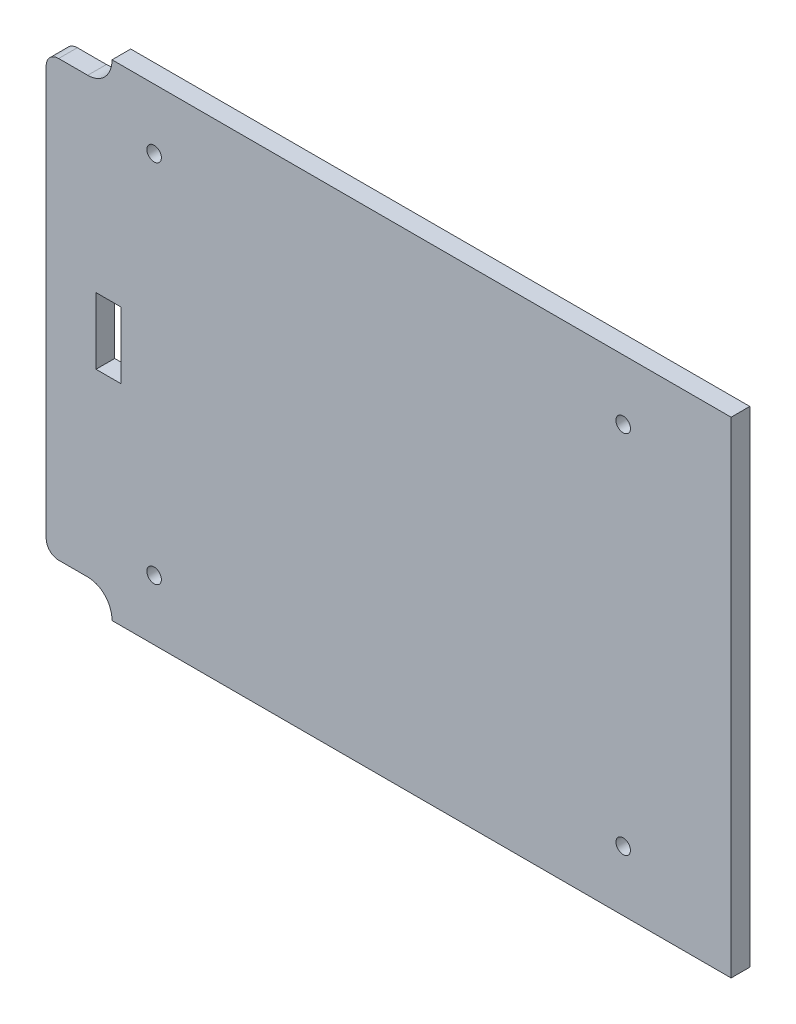
ISO-10303-21;
HEADER;
FILE_DESCRIPTION(('STEP AP214'),'2;1');
FILE_NAME('part.step','',(''),(''),'','','');
FILE_SCHEMA(('AUTOMOTIVE_DESIGN { 1 0 10303 214 1 1 1 1 }'));
ENDSEC;
DATA;
#1=APPLICATION_CONTEXT('core data for automotive mechanical design processes');
#2=APPLICATION_PROTOCOL_DEFINITION('international standard','automotive_design',2000,#1);
#3=PRODUCT_CONTEXT('',#1,'mechanical');
#4=PRODUCT('Part','Part','',(#3));
#5=PRODUCT_RELATED_PRODUCT_CATEGORY('part','',(#4));
#6=PRODUCT_DEFINITION_FORMATION('','',#4);
#7=PRODUCT_DEFINITION_CONTEXT('part definition',#1,'design');
#8=PRODUCT_DEFINITION('design','',#6,#7);
#9=PRODUCT_DEFINITION_SHAPE('','',#8);
#10=(LENGTH_UNIT() NAMED_UNIT(*) SI_UNIT(.MILLI.,.METRE.));
#11=(NAMED_UNIT(*) PLANE_ANGLE_UNIT() SI_UNIT($,.RADIAN.));
#12=(NAMED_UNIT(*) SI_UNIT($,.STERADIAN.) SOLID_ANGLE_UNIT());
#13=UNCERTAINTY_MEASURE_WITH_UNIT(LENGTH_MEASURE(1.E-05),#10,'distance_accuracy_value','');
#14=(GEOMETRIC_REPRESENTATION_CONTEXT(3) GLOBAL_UNCERTAINTY_ASSIGNED_CONTEXT((#13)) GLOBAL_UNIT_ASSIGNED_CONTEXT((#10,
#11,#12)) REPRESENTATION_CONTEXT('',''));
#15=CARTESIAN_POINT('',(0.,0.,0.));
#16=DIRECTION('',(0.,0.,1.));
#17=DIRECTION('',(1.,0.,0.));
#18=AXIS2_PLACEMENT_3D('',#15,#16,#17);
#19=CARTESIAN_POINT('',(82.5,-58.5,4.5));
#20=DIRECTION('',(0.,1.,0.));
#21=DIRECTION('',(-1.,0.,0.));
#22=AXIS2_PLACEMENT_3D('',#19,#20,#21);
#23=PLANE('',#22);
#24=DIRECTION('',(0.,0.,1.));
#25=VECTOR('',#24,1.);
#26=CARTESIAN_POINT('',(-66.6411254352264,-58.5,-0.00100000000000013));
#27=LINE('',#26,#25);
#28=CARTESIAN_POINT('',(-66.6411254352264,-58.5,0.));
#29=VERTEX_POINT('',#28);
#30=CARTESIAN_POINT('',(-66.6411254352264,-58.5,4.5));
#31=VERTEX_POINT('',#30);
#32=EDGE_CURVE('E159',#29,#31,#27,.T.);
#33=ORIENTED_EDGE('',*,*,#32,.F.);
#34=DIRECTION('',(1.,0.,0.));
#35=VECTOR('',#34,1.);
#36=CARTESIAN_POINT('',(82.5,-58.5,0.));
#37=LINE('',#36,#35);
#38=CARTESIAN_POINT('',(82.5,-58.5,0.));
#39=VERTEX_POINT('',#38);
#40=EDGE_CURVE('E172',#29,#39,#37,.T.);
#41=ORIENTED_EDGE('',*,*,#40,.T.);
#42=DIRECTION('',(0.,0.,-1.));
#43=VECTOR('',#42,1.);
#44=CARTESIAN_POINT('',(82.5,-58.5,4.5));
#45=LINE('',#44,#43);
#46=CARTESIAN_POINT('',(82.5,-58.5,4.5));
#47=VERTEX_POINT('',#46);
#48=EDGE_CURVE('E12',#47,#39,#45,.T.);
#49=ORIENTED_EDGE('',*,*,#48,.F.);
#50=DIRECTION('',(1.,0.,0.));
#51=VECTOR('',#50,1.);
#52=CARTESIAN_POINT('',(82.5,-58.5,4.5));
#53=LINE('',#52,#51);
#54=EDGE_CURVE('E173',#31,#47,#53,.T.);
#55=ORIENTED_EDGE('',*,*,#54,.F.);
#56=EDGE_LOOP('',(#33,#41,#49,#55));
#57=FACE_BOUND('',#56,.T.);
#58=ADVANCED_FACE('F40',(#57),#23,.F.);
#59=CARTESIAN_POINT('',(0.,0.,4.5));
#60=DIRECTION('',(0.,0.,1.));
#61=DIRECTION('',(1.,0.,0.));
#62=AXIS2_PLACEMENT_3D('',#59,#60,#61);
#63=PLANE('',#62);
#64=DIRECTION('',(0.,-1.,0.));
#65=VECTOR('',#64,1.);
#66=CARTESIAN_POINT('',(-70.5,-8.00000000000001,4.5));
#67=LINE('',#66,#65);
#68=CARTESIAN_POINT('',(-70.5,7.99999999999999,4.5));
#69=VERTEX_POINT('',#68);
#70=CARTESIAN_POINT('',(-70.5,-8.00000000000001,4.5));
#71=VERTEX_POINT('',#70);
#72=EDGE_CURVE('E275',#69,#71,#67,.T.);
#73=ORIENTED_EDGE('',*,*,#72,.F.);
#74=DIRECTION('',(-1.,0.,0.));
#75=VECTOR('',#74,1.);
#76=CARTESIAN_POINT('',(-64.5,7.99999999999999,4.5));
#77=LINE('',#76,#75);
#78=CARTESIAN_POINT('',(-64.5,7.99999999999999,4.5));
#79=VERTEX_POINT('',#78);
#80=EDGE_CURVE('E256',#79,#69,#77,.T.);
#81=ORIENTED_EDGE('',*,*,#80,.F.);
#82=DIRECTION('',(0.,1.,0.));
#83=VECTOR('',#82,1.);
#84=CARTESIAN_POINT('',(-64.5,-8.00000000000001,4.5));
#85=LINE('',#84,#83);
#86=CARTESIAN_POINT('',(-64.5,-8.00000000000001,4.5));
#87=VERTEX_POINT('',#86);
#88=EDGE_CURVE('E267',#87,#79,#85,.T.);
#89=ORIENTED_EDGE('',*,*,#88,.F.);
#90=DIRECTION('',(1.,0.,0.));
#91=VECTOR('',#90,1.);
#92=CARTESIAN_POINT('',(-64.5,-8.00000000000001,4.5));
#93=LINE('',#92,#91);
#94=EDGE_CURVE('E271',#71,#87,#93,.T.);
#95=ORIENTED_EDGE('',*,*,#94,.F.);
#96=EDGE_LOOP('',(#73,#81,#89,#95));
#97=FACE_BOUND('',#96,.T.);
#98=CARTESIAN_POINT('',(-56.5,-44.,4.5));
#99=DIRECTION('',(0.,0.,-1.));
#100=DIRECTION('',(1.,0.,0.));
#101=AXIS2_PLACEMENT_3D('',#98,#99,#100);
#102=CIRCLE('',#101,1.75);
#103=CARTESIAN_POINT('',(-54.75,-44.,4.5));
#104=VERTEX_POINT('',#103);
#105=EDGE_CURVE('E239',#104,#104,#102,.T.);
#106=ORIENTED_EDGE('',*,*,#105,.T.);
#107=EDGE_LOOP('',(#106));
#108=FACE_BOUND('',#107,.T.);
#109=CARTESIAN_POINT('',(56.5,-44.,4.5));
#110=DIRECTION('',(0.,0.,1.));
#111=DIRECTION('',(-1.,0.,0.));
#112=AXIS2_PLACEMENT_3D('',#109,#110,#111);
#113=CIRCLE('',#112,1.75);
#114=CARTESIAN_POINT('',(54.75,-44.,4.5));
#115=VERTEX_POINT('',#114);
#116=EDGE_CURVE('E231',#115,#115,#113,.T.);
#117=ORIENTED_EDGE('',*,*,#116,.F.);
#118=EDGE_LOOP('',(#117));
#119=FACE_BOUND('',#118,.T.);
#120=CARTESIAN_POINT('',(56.5,44.,4.5));
#121=DIRECTION('',(0.,0.,-1.));
#122=DIRECTION('',(-1.,0.,0.));
#123=AXIS2_PLACEMENT_3D('',#120,#121,#122);
#124=CIRCLE('',#123,1.75);
#125=CARTESIAN_POINT('',(54.75,44.,4.5));
#126=VERTEX_POINT('',#125);
#127=EDGE_CURVE('E223',#126,#126,#124,.T.);
#128=ORIENTED_EDGE('',*,*,#127,.T.);
#129=EDGE_LOOP('',(#128));
#130=FACE_BOUND('',#129,.T.);
#131=CARTESIAN_POINT('',(-56.5,44.,4.5));
#132=DIRECTION('',(0.,0.,1.));
#133=DIRECTION('',(1.,0.,0.));
#134=AXIS2_PLACEMENT_3D('',#131,#132,#133);
#135=CIRCLE('',#134,1.75);
#136=CARTESIAN_POINT('',(-54.75,44.,4.5));
#137=VERTEX_POINT('',#136);
#138=EDGE_CURVE('E215',#137,#137,#135,.T.);
#139=ORIENTED_EDGE('',*,*,#138,.F.);
#140=EDGE_LOOP('',(#139));
#141=FACE_BOUND('',#140,.T.);
#142=CARTESIAN_POINT('',(-72.4926257614116,-58.0906655237795,4.5));
#143=DIRECTION('',(0.,0.,-1.));
#144=DIRECTION('',(1.,0.,0.));
#145=AXIS2_PLACEMENT_3D('',#142,#143,#144);
#146=CIRCLE('',#145,5.752251219434);
#147=CARTESIAN_POINT('',(-72.4926257614116,-52.3384143043455,4.5));
#148=VERTEX_POINT('',#147);
#149=CARTESIAN_POINT('',(-67.3791599057483,-55.4561141322812,4.5));
#150=VERTEX_POINT('',#149);
#151=EDGE_CURVE('E166',#148,#150,#146,.T.);
#152=ORIENTED_EDGE('',*,*,#151,.T.);
#153=CARTESIAN_POINT('',(-73.2871131547698,-58.5,4.5));
#154=DIRECTION('',(0.,0.,-1.));
#155=DIRECTION('',(1.,0.,0.));
#156=AXIS2_PLACEMENT_3D('',#153,#154,#155);
#157=CIRCLE('',#156,6.64598771954342);
#158=EDGE_CURVE('E339',#150,#31,#157,.T.);
#159=ORIENTED_EDGE('',*,*,#158,.T.);
#160=ORIENTED_EDGE('',*,*,#54,.T.);
#161=DIRECTION('',(0.,1.,0.));
#162=VECTOR('',#161,1.);
#163=CARTESIAN_POINT('',(82.5,-58.5,4.5));
#164=LINE('',#163,#162);
#165=CARTESIAN_POINT('',(82.5,58.5,4.5));
#166=VERTEX_POINT('',#165);
#167=EDGE_CURVE('E204',#47,#166,#164,.T.);
#168=ORIENTED_EDGE('',*,*,#167,.T.);
#169=DIRECTION('',(-1.,0.,0.));
#170=VECTOR('',#169,1.);
#171=CARTESIAN_POINT('',(82.5,58.5,4.5));
#172=LINE('',#171,#170);
#173=CARTESIAN_POINT('',(-66.6411254352264,58.5,4.5));
#174=VERTEX_POINT('',#173);
#175=EDGE_CURVE('E198',#166,#174,#172,.T.);
#176=ORIENTED_EDGE('',*,*,#175,.T.);
#177=CARTESIAN_POINT('',(-73.2871131547698,58.5,4.5));
#178=DIRECTION('',(0.,0.,1.));
#179=DIRECTION('',(1.,0.,0.));
#180=AXIS2_PLACEMENT_3D('',#177,#178,#179);
#181=CIRCLE('',#180,6.64598771954342);
#182=CARTESIAN_POINT('',(-67.3791599057483,55.4561141322812,4.5));
#183=VERTEX_POINT('',#182);
#184=EDGE_CURVE('E314',#183,#174,#181,.T.);
#185=ORIENTED_EDGE('',*,*,#184,.F.);
#186=CARTESIAN_POINT('',(-72.4926257614116,58.0906655237795,4.5));
#187=DIRECTION('',(0.,0.,1.));
#188=DIRECTION('',(1.,0.,0.));
#189=AXIS2_PLACEMENT_3D('',#186,#187,#188);
#190=CIRCLE('',#189,5.752251219434);
#191=CARTESIAN_POINT('',(-72.4926257614116,52.3384143043455,4.5));
#192=VERTEX_POINT('',#191);
#193=EDGE_CURVE('E317',#192,#183,#190,.T.);
#194=ORIENTED_EDGE('',*,*,#193,.F.);
#195=DIRECTION('',(1.,0.,0.));
#196=VECTOR('',#195,1.);
#197=CARTESIAN_POINT('',(0.,52.3384143043455,4.5));
#198=LINE('',#197,#196);
#199=CARTESIAN_POINT('',(-79.5015936084169,52.3384143043455,4.5));
#200=VERTEX_POINT('',#199);
#201=EDGE_CURVE('E296',#200,#192,#198,.T.);
#202=ORIENTED_EDGE('',*,*,#201,.F.);
#203=CARTESIAN_POINT('',(-79.5015936084169,49.3400079127624,4.5));
#204=DIRECTION('',(0.,0.,1.));
#205=DIRECTION('',(1.,0.,0.));
#206=AXIS2_PLACEMENT_3D('',#203,#204,#205);
#207=CIRCLE('',#206,2.99840639158309);
#208=CARTESIAN_POINT('',(-82.5,49.3400079127624,4.5));
#209=VERTEX_POINT('',#208);
#210=EDGE_CURVE('E310',#209,#200,#207,.F.);
#211=ORIENTED_EDGE('',*,*,#210,.F.);
#212=DIRECTION('',(0.,-1.,0.));
#213=VECTOR('',#212,1.);
#214=CARTESIAN_POINT('',(-82.5,-58.5,4.5));
#215=LINE('',#214,#213);
#216=CARTESIAN_POINT('',(-82.5,-49.3400079127624,4.5));
#217=VERTEX_POINT('',#216);
#218=EDGE_CURVE('E195',#209,#217,#215,.T.);
#219=ORIENTED_EDGE('',*,*,#218,.T.);
#220=CARTESIAN_POINT('',(-79.5015936084169,-49.3400079127624,4.5));
#221=DIRECTION('',(0.,0.,-1.));
#222=DIRECTION('',(1.,0.,0.));
#223=AXIS2_PLACEMENT_3D('',#220,#221,#222);
#224=CIRCLE('',#223,2.99840639158309);
#225=CARTESIAN_POINT('',(-79.5015936084169,-52.3384143043455,4.5));
#226=VERTEX_POINT('',#225);
#227=EDGE_CURVE('E349',#217,#226,#224,.F.);
#228=ORIENTED_EDGE('',*,*,#227,.T.);
#229=DIRECTION('',(1.,0.,0.));
#230=VECTOR('',#229,1.);
#231=CARTESIAN_POINT('',(0.,-52.3384143043455,4.5));
#232=LINE('',#231,#230);
#233=EDGE_CURVE('E353',#226,#148,#232,.T.);
#234=ORIENTED_EDGE('',*,*,#233,.T.);
#235=EDGE_LOOP('',(#152,#159,#160,#168,#176,#185,#194,#202,#211,#219,#228,#234));
#236=FACE_BOUND('',#235,.T.);
#237=ADVANCED_FACE('F375',(#97,#108,#119,#130,#141,#236),#63,.T.);
#238=CARTESIAN_POINT('',(0.,0.,0.));
#239=DIRECTION('',(0.,0.,1.));
#240=DIRECTION('',(1.,0.,0.));
#241=AXIS2_PLACEMENT_3D('',#238,#239,#240);
#242=PLANE('',#241);
#243=CARTESIAN_POINT('',(-56.5,44.,0.));
#244=DIRECTION('',(0.,0.,1.));
#245=DIRECTION('',(1.,0.,0.));
#246=AXIS2_PLACEMENT_3D('',#243,#244,#245);
#247=CIRCLE('',#246,1.75);
#248=CARTESIAN_POINT('',(-54.75,44.,0.));
#249=VERTEX_POINT('',#248);
#250=EDGE_CURVE('E189',#249,#249,#247,.T.);
#251=ORIENTED_EDGE('',*,*,#250,.T.);
#252=EDGE_LOOP('',(#251));
#253=FACE_BOUND('',#252,.T.);
#254=CARTESIAN_POINT('',(56.5,44.,0.));
#255=DIRECTION('',(0.,0.,-1.));
#256=DIRECTION('',(-1.,0.,0.));
#257=AXIS2_PLACEMENT_3D('',#254,#255,#256);
#258=CIRCLE('',#257,1.75);
#259=CARTESIAN_POINT('',(54.75,44.,0.));
#260=VERTEX_POINT('',#259);
#261=EDGE_CURVE('E219',#260,#260,#258,.T.);
#262=ORIENTED_EDGE('',*,*,#261,.F.);
#263=EDGE_LOOP('',(#262));
#264=FACE_BOUND('',#263,.T.);
#265=CARTESIAN_POINT('',(56.5,-44.,0.));
#266=DIRECTION('',(0.,0.,1.));
#267=DIRECTION('',(-1.,0.,0.));
#268=AXIS2_PLACEMENT_3D('',#265,#266,#267);
#269=CIRCLE('',#268,1.75);
#270=CARTESIAN_POINT('',(54.75,-44.,0.));
#271=VERTEX_POINT('',#270);
#272=EDGE_CURVE('E227',#271,#271,#269,.T.);
#273=ORIENTED_EDGE('',*,*,#272,.T.);
#274=EDGE_LOOP('',(#273));
#275=FACE_BOUND('',#274,.T.);
#276=CARTESIAN_POINT('',(-56.5,-44.,0.));
#277=DIRECTION('',(0.,0.,-1.));
#278=DIRECTION('',(1.,0.,0.));
#279=AXIS2_PLACEMENT_3D('',#276,#277,#278);
#280=CIRCLE('',#279,1.75);
#281=CARTESIAN_POINT('',(-54.75,-44.,0.));
#282=VERTEX_POINT('',#281);
#283=EDGE_CURVE('E235',#282,#282,#280,.T.);
#284=ORIENTED_EDGE('',*,*,#283,.F.);
#285=EDGE_LOOP('',(#284));
#286=FACE_BOUND('',#285,.T.);
#287=DIRECTION('',(1.,0.,0.));
#288=VECTOR('',#287,1.);
#289=CARTESIAN_POINT('',(-64.5,7.99999999999999,0.));
#290=LINE('',#289,#288);
#291=CARTESIAN_POINT('',(-70.5,7.99999999999999,0.));
#292=VERTEX_POINT('',#291);
#293=CARTESIAN_POINT('',(-64.5,7.99999999999999,0.));
#294=VERTEX_POINT('',#293);
#295=EDGE_CURVE('E282',#292,#294,#290,.T.);
#296=ORIENTED_EDGE('',*,*,#295,.F.);
#297=DIRECTION('',(0.,1.,0.));
#298=VECTOR('',#297,1.);
#299=CARTESIAN_POINT('',(-70.5,-8.00000000000001,0.));
#300=LINE('',#299,#298);
#301=CARTESIAN_POINT('',(-70.5,-8.00000000000001,0.));
#302=VERTEX_POINT('',#301);
#303=EDGE_CURVE('E278',#302,#292,#300,.T.);
#304=ORIENTED_EDGE('',*,*,#303,.F.);
#305=DIRECTION('',(-1.,0.,0.));
#306=VECTOR('',#305,1.);
#307=CARTESIAN_POINT('',(-64.5,-8.00000000000001,0.));
#308=LINE('',#307,#306);
#309=CARTESIAN_POINT('',(-64.5,-8.00000000000001,0.));
#310=VERTEX_POINT('',#309);
#311=EDGE_CURVE('E243',#310,#302,#308,.T.);
#312=ORIENTED_EDGE('',*,*,#311,.F.);
#313=DIRECTION('',(0.,-1.,0.));
#314=VECTOR('',#313,1.);
#315=CARTESIAN_POINT('',(-64.5,-8.00000000000001,0.));
#316=LINE('',#315,#314);
#317=EDGE_CURVE('E286',#294,#310,#316,.T.);
#318=ORIENTED_EDGE('',*,*,#317,.F.);
#319=EDGE_LOOP('',(#296,#304,#312,#318));
#320=FACE_BOUND('',#319,.T.);
#321=CARTESIAN_POINT('',(-73.2871131547698,-58.5,0.));
#322=DIRECTION('',(0.,0.,1.));
#323=DIRECTION('',(1.,0.,0.));
#324=AXIS2_PLACEMENT_3D('',#321,#322,#323);
#325=CIRCLE('',#324,6.64598771954342);
#326=CARTESIAN_POINT('',(-67.3791599057483,-55.4561141322812,0.));
#327=VERTEX_POINT('',#326);
#328=EDGE_CURVE('E155',#29,#327,#325,.T.);
#329=ORIENTED_EDGE('',*,*,#328,.T.);
#330=CARTESIAN_POINT('',(-72.4926257614116,-58.0906655237795,0.));
#331=DIRECTION('',(0.,0.,1.));
#332=DIRECTION('',(1.,0.,0.));
#333=AXIS2_PLACEMENT_3D('',#330,#331,#332);
#334=CIRCLE('',#333,5.752251219434);
#335=CARTESIAN_POINT('',(-72.4926257614116,-52.3384143043455,0.));
#336=VERTEX_POINT('',#335);
#337=EDGE_CURVE('E167',#327,#336,#334,.T.);
#338=ORIENTED_EDGE('',*,*,#337,.T.);
#339=DIRECTION('',(-1.,0.,0.));
#340=VECTOR('',#339,1.);
#341=CARTESIAN_POINT('',(0.,-52.3384143043455,0.));
#342=LINE('',#341,#340);
#343=CARTESIAN_POINT('',(-79.5015936084169,-52.3384143043455,0.));
#344=VERTEX_POINT('',#343);
#345=EDGE_CURVE('E332',#336,#344,#342,.T.);
#346=ORIENTED_EDGE('',*,*,#345,.T.);
#347=CARTESIAN_POINT('',(-79.5015936084169,-49.3400079127624,0.));
#348=DIRECTION('',(0.,0.,1.));
#349=DIRECTION('',(1.,0.,0.));
#350=AXIS2_PLACEMENT_3D('',#347,#348,#349);
#351=CIRCLE('',#350,2.99840639158309);
#352=CARTESIAN_POINT('',(-82.5,-49.3400079127624,0.));
#353=VERTEX_POINT('',#352);
#354=EDGE_CURVE('E362',#344,#353,#351,.F.);
#355=ORIENTED_EDGE('',*,*,#354,.T.);
#356=DIRECTION('',(0.,-1.,0.));
#357=VECTOR('',#356,1.);
#358=CARTESIAN_POINT('',(-82.5,-58.5,0.));
#359=LINE('',#358,#357);
#360=CARTESIAN_POINT('',(-82.5,49.3400079127624,0.));
#361=VERTEX_POINT('',#360);
#362=EDGE_CURVE('E182',#361,#353,#359,.T.);
#363=ORIENTED_EDGE('',*,*,#362,.F.);
#364=CARTESIAN_POINT('',(-79.5015936084169,49.3400079127624,0.));
#365=DIRECTION('',(0.,0.,1.));
#366=DIRECTION('',(1.,0.,0.));
#367=AXIS2_PLACEMENT_3D('',#364,#365,#366);
#368=CIRCLE('',#367,2.99840639158309);
#369=CARTESIAN_POINT('',(-79.5015936084169,52.3384143043455,0.));
#370=VERTEX_POINT('',#369);
#371=EDGE_CURVE('E321',#370,#361,#368,.T.);
#372=ORIENTED_EDGE('',*,*,#371,.F.);
#373=DIRECTION('',(-1.,0.,0.));
#374=VECTOR('',#373,1.);
#375=CARTESIAN_POINT('',(0.,52.3384143043455,0.));
#376=LINE('',#375,#374);
#377=CARTESIAN_POINT('',(-72.4926257614116,52.3384143043455,0.));
#378=VERTEX_POINT('',#377);
#379=EDGE_CURVE('E324',#378,#370,#376,.T.);
#380=ORIENTED_EDGE('',*,*,#379,.F.);
#381=CARTESIAN_POINT('',(-72.4926257614116,58.0906655237795,0.));
#382=DIRECTION('',(0.,0.,1.));
#383=DIRECTION('',(1.,0.,0.));
#384=AXIS2_PLACEMENT_3D('',#381,#382,#383);
#385=CIRCLE('',#384,5.752251219434);
#386=CARTESIAN_POINT('',(-67.3791599057483,55.4561141322812,0.));
#387=VERTEX_POINT('',#386);
#388=EDGE_CURVE('E328',#387,#378,#385,.F.);
#389=ORIENTED_EDGE('',*,*,#388,.F.);
#390=CARTESIAN_POINT('',(-73.2871131547698,58.5,0.));
#391=DIRECTION('',(0.,0.,1.));
#392=DIRECTION('',(1.,0.,0.));
#393=AXIS2_PLACEMENT_3D('',#390,#391,#392);
#394=CIRCLE('',#393,6.64598771954342);
#395=CARTESIAN_POINT('',(-66.6411254352264,58.5,0.));
#396=VERTEX_POINT('',#395);
#397=EDGE_CURVE('E289',#396,#387,#394,.F.);
#398=ORIENTED_EDGE('',*,*,#397,.F.);
#399=DIRECTION('',(-1.,0.,0.));
#400=VECTOR('',#399,1.);
#401=CARTESIAN_POINT('',(82.5,58.5,0.));
#402=LINE('',#401,#400);
#403=CARTESIAN_POINT('',(82.5,58.5,0.));
#404=VERTEX_POINT('',#403);
#405=EDGE_CURVE('E186',#404,#396,#402,.T.);
#406=ORIENTED_EDGE('',*,*,#405,.F.);
#407=DIRECTION('',(0.,1.,0.));
#408=VECTOR('',#407,1.);
#409=CARTESIAN_POINT('',(82.5,-58.5,0.));
#410=LINE('',#409,#408);
#411=EDGE_CURVE('E180',#39,#404,#410,.T.);
#412=ORIENTED_EDGE('',*,*,#411,.F.);
#413=ORIENTED_EDGE('',*,*,#40,.F.);
#414=EDGE_LOOP('',(#329,#338,#346,#355,#363,#372,#380,#389,#398,#406,#412,#413));
#415=FACE_BOUND('',#414,.T.);
#416=ADVANCED_FACE('F178',(#253,#264,#275,#286,#320,#415),#242,.F.);
#417=CARTESIAN_POINT('',(-82.5,-58.5,4.5));
#418=DIRECTION('',(1.,0.,0.));
#419=DIRECTION('',(0.,0.,-1.));
#420=AXIS2_PLACEMENT_3D('',#417,#418,#419);
#421=PLANE('',#420);
#422=ORIENTED_EDGE('',*,*,#362,.T.);
#423=DIRECTION('',(0.,0.,1.));
#424=VECTOR('',#423,1.);
#425=CARTESIAN_POINT('',(-82.5,-49.3400079127624,-0.00100000000000013));
#426=LINE('',#425,#424);
#427=EDGE_CURVE('E175',#353,#217,#426,.T.);
#428=ORIENTED_EDGE('',*,*,#427,.T.);
#429=ORIENTED_EDGE('',*,*,#218,.F.);
#430=DIRECTION('',(0.,0.,1.));
#431=VECTOR('',#430,1.);
#432=CARTESIAN_POINT('',(-82.5,49.3400079127624,-0.00100000000000013));
#433=LINE('',#432,#431);
#434=EDGE_CURVE('E299',#361,#209,#433,.T.);
#435=ORIENTED_EDGE('',*,*,#434,.F.);
#436=EDGE_LOOP('',(#422,#428,#429,#435));
#437=FACE_BOUND('',#436,.T.);
#438=ADVANCED_FACE('F42',(#437),#421,.F.);
#439=CARTESIAN_POINT('',(82.5,-58.5,4.5));
#440=DIRECTION('',(-1.,0.,0.));
#441=DIRECTION('',(0.,0.,1.));
#442=AXIS2_PLACEMENT_3D('',#439,#440,#441);
#443=PLANE('',#442);
#444=ORIENTED_EDGE('',*,*,#411,.T.);
#445=DIRECTION('',(0.,0.,-1.));
#446=VECTOR('',#445,1.);
#447=CARTESIAN_POINT('',(82.5,58.5,4.5));
#448=LINE('',#447,#446);
#449=EDGE_CURVE('E49',#166,#404,#448,.T.);
#450=ORIENTED_EDGE('',*,*,#449,.F.);
#451=ORIENTED_EDGE('',*,*,#167,.F.);
#452=ORIENTED_EDGE('',*,*,#48,.T.);
#453=EDGE_LOOP('',(#444,#450,#451,#452));
#454=FACE_BOUND('',#453,.T.);
#455=ADVANCED_FACE('F402',(#454),#443,.F.);
#456=CARTESIAN_POINT('',(82.5,58.5,4.5));
#457=DIRECTION('',(0.,-1.,0.));
#458=DIRECTION('',(1.,0.,0.));
#459=AXIS2_PLACEMENT_3D('',#456,#457,#458);
#460=PLANE('',#459);
#461=ORIENTED_EDGE('',*,*,#405,.T.);
#462=DIRECTION('',(0.,0.,1.));
#463=VECTOR('',#462,1.);
#464=CARTESIAN_POINT('',(-66.6411254352264,58.5,-0.00100000000000013));
#465=LINE('',#464,#463);
#466=EDGE_CURVE('E64',#396,#174,#465,.T.);
#467=ORIENTED_EDGE('',*,*,#466,.T.);
#468=ORIENTED_EDGE('',*,*,#175,.F.);
#469=ORIENTED_EDGE('',*,*,#449,.T.);
#470=EDGE_LOOP('',(#461,#467,#468,#469));
#471=FACE_BOUND('',#470,.T.);
#472=ADVANCED_FACE('F405',(#471),#460,.F.);
#473=CARTESIAN_POINT('',(-56.5,44.,0.));
#474=DIRECTION('',(0.,0.,1.));
#475=DIRECTION('',(1.,0.,0.));
#476=AXIS2_PLACEMENT_3D('',#473,#474,#475);
#477=CYLINDRICAL_SURFACE('',#476,1.75);
#478=ORIENTED_EDGE('',*,*,#250,.F.);
#479=EDGE_LOOP('',(#478));
#480=FACE_BOUND('',#479,.T.);
#481=ORIENTED_EDGE('',*,*,#138,.T.);
#482=EDGE_LOOP('',(#481));
#483=FACE_BOUND('',#482,.T.);
#484=ADVANCED_FACE('F409',(#480,#483),#477,.F.);
#485=CARTESIAN_POINT('',(56.5,44.,0.));
#486=DIRECTION('',(0.,0.,1.));
#487=DIRECTION('',(1.,0.,0.));
#488=AXIS2_PLACEMENT_3D('',#485,#486,#487);
#489=CYLINDRICAL_SURFACE('',#488,1.75);
#490=ORIENTED_EDGE('',*,*,#261,.T.);
#491=EDGE_LOOP('',(#490));
#492=FACE_BOUND('',#491,.T.);
#493=ORIENTED_EDGE('',*,*,#127,.F.);
#494=EDGE_LOOP('',(#493));
#495=FACE_BOUND('',#494,.T.);
#496=ADVANCED_FACE('F415',(#492,#495),#489,.F.);
#497=CARTESIAN_POINT('',(56.5,-44.,0.));
#498=DIRECTION('',(0.,0.,1.));
#499=DIRECTION('',(1.,0.,0.));
#500=AXIS2_PLACEMENT_3D('',#497,#498,#499);
#501=CYLINDRICAL_SURFACE('',#500,1.75);
#502=ORIENTED_EDGE('',*,*,#272,.F.);
#503=EDGE_LOOP('',(#502));
#504=FACE_BOUND('',#503,.T.);
#505=ORIENTED_EDGE('',*,*,#116,.T.);
#506=EDGE_LOOP('',(#505));
#507=FACE_BOUND('',#506,.T.);
#508=ADVANCED_FACE('F419',(#504,#507),#501,.F.);
#509=CARTESIAN_POINT('',(-56.5,-44.,0.));
#510=DIRECTION('',(0.,0.,1.));
#511=DIRECTION('',(1.,0.,0.));
#512=AXIS2_PLACEMENT_3D('',#509,#510,#511);
#513=CYLINDRICAL_SURFACE('',#512,1.75);
#514=ORIENTED_EDGE('',*,*,#283,.T.);
#515=EDGE_LOOP('',(#514));
#516=FACE_BOUND('',#515,.T.);
#517=ORIENTED_EDGE('',*,*,#105,.F.);
#518=EDGE_LOOP('',(#517));
#519=FACE_BOUND('',#518,.T.);
#520=ADVANCED_FACE('F423',(#516,#519),#513,.F.);
#521=CARTESIAN_POINT('',(-70.5,-8.00000000000001,-0.00100000000000013));
#522=DIRECTION('',(-1.,0.,0.));
#523=DIRECTION('',(0.,0.,1.));
#524=AXIS2_PLACEMENT_3D('',#521,#522,#523);
#525=PLANE('',#524);
#526=ORIENTED_EDGE('',*,*,#303,.T.);
#527=DIRECTION('',(0.,0.,1.));
#528=VECTOR('',#527,1.);
#529=CARTESIAN_POINT('',(-70.5,7.99999999999999,-0.00100000000000013));
#530=LINE('',#529,#528);
#531=EDGE_CURVE('E250',#292,#69,#530,.T.);
#532=ORIENTED_EDGE('',*,*,#531,.T.);
#533=ORIENTED_EDGE('',*,*,#72,.T.);
#534=DIRECTION('',(0.,0.,1.));
#535=VECTOR('',#534,1.);
#536=CARTESIAN_POINT('',(-70.5,-8.00000000000001,-0.00100000000000013));
#537=LINE('',#536,#535);
#538=EDGE_CURVE('E251',#302,#71,#537,.T.);
#539=ORIENTED_EDGE('',*,*,#538,.F.);
#540=EDGE_LOOP('',(#526,#532,#533,#539));
#541=FACE_BOUND('',#540,.T.);
#542=ADVANCED_FACE('F427',(#541),#525,.F.);
#543=CARTESIAN_POINT('',(-64.5,7.99999999999999,-0.00100000000000013));
#544=DIRECTION('',(0.,1.,0.));
#545=DIRECTION('',(-1.,0.,0.));
#546=AXIS2_PLACEMENT_3D('',#543,#544,#545);
#547=PLANE('',#546);
#548=ORIENTED_EDGE('',*,*,#295,.T.);
#549=DIRECTION('',(0.,0.,1.));
#550=VECTOR('',#549,1.);
#551=CARTESIAN_POINT('',(-64.5,7.99999999999999,-0.00100000000000013));
#552=LINE('',#551,#550);
#553=EDGE_CURVE('E259',#294,#79,#552,.T.);
#554=ORIENTED_EDGE('',*,*,#553,.T.);
#555=ORIENTED_EDGE('',*,*,#80,.T.);
#556=ORIENTED_EDGE('',*,*,#531,.F.);
#557=EDGE_LOOP('',(#548,#554,#555,#556));
#558=FACE_BOUND('',#557,.T.);
#559=ADVANCED_FACE('F431',(#558),#547,.F.);
#560=CARTESIAN_POINT('',(-64.5,-8.00000000000001,-0.00100000000000013));
#561=DIRECTION('',(1.,0.,0.));
#562=DIRECTION('',(0.,0.,-1.));
#563=AXIS2_PLACEMENT_3D('',#560,#561,#562);
#564=PLANE('',#563);
#565=ORIENTED_EDGE('',*,*,#317,.T.);
#566=DIRECTION('',(0.,0.,1.));
#567=VECTOR('',#566,1.);
#568=CARTESIAN_POINT('',(-64.5,-8.00000000000001,-0.00100000000000013));
#569=LINE('',#568,#567);
#570=EDGE_CURVE('E255',#310,#87,#569,.T.);
#571=ORIENTED_EDGE('',*,*,#570,.T.);
#572=ORIENTED_EDGE('',*,*,#88,.T.);
#573=ORIENTED_EDGE('',*,*,#553,.F.);
#574=EDGE_LOOP('',(#565,#571,#572,#573));
#575=FACE_BOUND('',#574,.T.);
#576=ADVANCED_FACE('F436',(#575),#564,.F.);
#577=CARTESIAN_POINT('',(-64.5,-8.00000000000001,-0.00100000000000013));
#578=DIRECTION('',(0.,-1.,0.));
#579=DIRECTION('',(0.,0.,-1.));
#580=AXIS2_PLACEMENT_3D('',#577,#578,#579);
#581=PLANE('',#580);
#582=ORIENTED_EDGE('',*,*,#311,.T.);
#583=ORIENTED_EDGE('',*,*,#538,.T.);
#584=ORIENTED_EDGE('',*,*,#94,.T.);
#585=ORIENTED_EDGE('',*,*,#570,.F.);
#586=EDGE_LOOP('',(#582,#583,#584,#585));
#587=FACE_BOUND('',#586,.T.);
#588=ADVANCED_FACE('F433',(#587),#581,.F.);
#589=CARTESIAN_POINT('',(-72.4926257614116,58.0906655237795,-0.00100000000000013));
#590=DIRECTION('',(0.,0.,1.));
#591=DIRECTION('',(1.,0.,0.));
#592=AXIS2_PLACEMENT_3D('',#589,#590,#591);
#593=CYLINDRICAL_SURFACE('',#592,5.752251219434);
#594=ORIENTED_EDGE('',*,*,#388,.T.);
#595=DIRECTION('',(0.,0.,1.));
#596=VECTOR('',#595,1.);
#597=CARTESIAN_POINT('',(-72.4926257614116,52.3384143043455,-0.00100000000000013));
#598=LINE('',#597,#596);
#599=EDGE_CURVE('E292',#378,#192,#598,.T.);
#600=ORIENTED_EDGE('',*,*,#599,.T.);
#601=ORIENTED_EDGE('',*,*,#193,.T.);
#602=DIRECTION('',(0.,0.,1.));
#603=VECTOR('',#602,1.);
#604=CARTESIAN_POINT('',(-67.3791599057483,55.4561141322812,-0.00100000000000013));
#605=LINE('',#604,#603);
#606=EDGE_CURVE('E293',#387,#183,#605,.T.);
#607=ORIENTED_EDGE('',*,*,#606,.F.);
#608=EDGE_LOOP('',(#594,#600,#601,#607));
#609=FACE_BOUND('',#608,.T.);
#610=ADVANCED_FACE('F382',(#609),#593,.F.);
#611=CARTESIAN_POINT('',(0.,52.3384143043455,-0.00100000000000013));
#612=DIRECTION('',(0.,-1.,0.));
#613=DIRECTION('',(0.,0.,-1.));
#614=AXIS2_PLACEMENT_3D('',#611,#612,#613);
#615=PLANE('',#614);
#616=ORIENTED_EDGE('',*,*,#379,.T.);
#617=DIRECTION('',(0.,0.,1.));
#618=VECTOR('',#617,1.);
#619=CARTESIAN_POINT('',(-79.5015936084169,52.3384143043455,-0.00100000000000013));
#620=LINE('',#619,#618);
#621=EDGE_CURVE('E302',#370,#200,#620,.T.);
#622=ORIENTED_EDGE('',*,*,#621,.T.);
#623=ORIENTED_EDGE('',*,*,#201,.T.);
#624=ORIENTED_EDGE('',*,*,#599,.F.);
#625=EDGE_LOOP('',(#616,#622,#623,#624));
#626=FACE_BOUND('',#625,.T.);
#627=ADVANCED_FACE('F378',(#626),#615,.F.);
#628=CARTESIAN_POINT('',(-79.5015936084169,49.3400079127624,-0.00100000000000013));
#629=DIRECTION('',(0.,0.,1.));
#630=DIRECTION('',(1.,0.,0.));
#631=AXIS2_PLACEMENT_3D('',#628,#629,#630);
#632=CYLINDRICAL_SURFACE('',#631,2.99840639158309);
#633=ORIENTED_EDGE('',*,*,#371,.T.);
#634=ORIENTED_EDGE('',*,*,#434,.T.);
#635=ORIENTED_EDGE('',*,*,#210,.T.);
#636=ORIENTED_EDGE('',*,*,#621,.F.);
#637=EDGE_LOOP('',(#633,#634,#635,#636));
#638=FACE_BOUND('',#637,.T.);
#639=ADVANCED_FACE('F373',(#638),#632,.T.);
#640=CARTESIAN_POINT('',(-73.2871131547698,58.5,-0.00100000000000013));
#641=DIRECTION('',(0.,0.,1.));
#642=DIRECTION('',(1.,0.,0.));
#643=AXIS2_PLACEMENT_3D('',#640,#641,#642);
#644=CYLINDRICAL_SURFACE('',#643,6.64598771954342);
#645=ORIENTED_EDGE('',*,*,#397,.T.);
#646=ORIENTED_EDGE('',*,*,#606,.T.);
#647=ORIENTED_EDGE('',*,*,#184,.T.);
#648=ORIENTED_EDGE('',*,*,#466,.F.);
#649=EDGE_LOOP('',(#645,#646,#647,#648));
#650=FACE_BOUND('',#649,.T.);
#651=ADVANCED_FACE('F383',(#650),#644,.F.);
#652=CARTESIAN_POINT('',(-72.4926257614116,-58.0906655237795,-0.00100000000000013));
#653=DIRECTION('',(0.,0.,1.));
#654=DIRECTION('',(1.,0.,0.));
#655=AXIS2_PLACEMENT_3D('',#652,#653,#654);
#656=CYLINDRICAL_SURFACE('',#655,5.752251219434);
#657=DIRECTION('',(0.,0.,1.));
#658=VECTOR('',#657,1.);
#659=CARTESIAN_POINT('',(-67.3791599057483,-55.4561141322812,-0.00100000000000013));
#660=LINE('',#659,#658);
#661=EDGE_CURVE('E161',#327,#150,#660,.T.);
#662=ORIENTED_EDGE('',*,*,#661,.T.);
#663=ORIENTED_EDGE('',*,*,#151,.F.);
#664=DIRECTION('',(0.,0.,1.));
#665=VECTOR('',#664,1.);
#666=CARTESIAN_POINT('',(-72.4926257614116,-52.3384143043455,-0.00100000000000013));
#667=LINE('',#666,#665);
#668=EDGE_CURVE('E336',#336,#148,#667,.T.);
#669=ORIENTED_EDGE('',*,*,#668,.F.);
#670=ORIENTED_EDGE('',*,*,#337,.F.);
#671=EDGE_LOOP('',(#662,#663,#669,#670));
#672=FACE_BOUND('',#671,.T.);
#673=ADVANCED_FACE('F385',(#672),#656,.F.);
#674=CARTESIAN_POINT('',(-73.2871131547698,-58.5,-0.00100000000000013));
#675=DIRECTION('',(0.,0.,1.));
#676=DIRECTION('',(1.,0.,0.));
#677=AXIS2_PLACEMENT_3D('',#674,#675,#676);
#678=CYLINDRICAL_SURFACE('',#677,6.64598771954342);
#679=ORIENTED_EDGE('',*,*,#32,.T.);
#680=ORIENTED_EDGE('',*,*,#158,.F.);
#681=ORIENTED_EDGE('',*,*,#661,.F.);
#682=ORIENTED_EDGE('',*,*,#328,.F.);
#683=EDGE_LOOP('',(#679,#680,#681,#682));
#684=FACE_BOUND('',#683,.T.);
#685=ADVANCED_FACE('F157',(#684),#678,.F.);
#686=CARTESIAN_POINT('',(-79.5015936084169,-49.3400079127624,-0.00100000000000013));
#687=DIRECTION('',(0.,0.,1.));
#688=DIRECTION('',(1.,0.,0.));
#689=AXIS2_PLACEMENT_3D('',#686,#687,#688);
#690=CYLINDRICAL_SURFACE('',#689,2.99840639158309);
#691=DIRECTION('',(0.,0.,1.));
#692=VECTOR('',#691,1.);
#693=CARTESIAN_POINT('',(-79.5015936084169,-52.3384143043455,-0.00100000000000013));
#694=LINE('',#693,#692);
#695=EDGE_CURVE('E56',#344,#226,#694,.T.);
#696=ORIENTED_EDGE('',*,*,#695,.T.);
#697=ORIENTED_EDGE('',*,*,#227,.F.);
#698=ORIENTED_EDGE('',*,*,#427,.F.);
#699=ORIENTED_EDGE('',*,*,#354,.F.);
#700=EDGE_LOOP('',(#696,#697,#698,#699));
#701=FACE_BOUND('',#700,.T.);
#702=ADVANCED_FACE('F455',(#701),#690,.T.);
#703=CARTESIAN_POINT('',(0.,-52.3384143043455,-0.00100000000000013));
#704=DIRECTION('',(0.,-1.,0.));
#705=DIRECTION('',(0.,0.,-1.));
#706=AXIS2_PLACEMENT_3D('',#703,#704,#705);
#707=PLANE('',#706);
#708=ORIENTED_EDGE('',*,*,#668,.T.);
#709=ORIENTED_EDGE('',*,*,#233,.F.);
#710=ORIENTED_EDGE('',*,*,#695,.F.);
#711=ORIENTED_EDGE('',*,*,#345,.F.);
#712=EDGE_LOOP('',(#708,#709,#710,#711));
#713=FACE_BOUND('',#712,.T.);
#714=ADVANCED_FACE('F452',(#713),#707,.T.);
#715=CLOSED_SHELL('',(#58,#237,#416,#438,#455,#472,#484,#496,#508,#520,#542,#559,#576,#588,#610,
#627,#639,#651,#673,#685,#702,#714));
#716=MANIFOLD_SOLID_BREP('B2',#715);
#717=ADVANCED_BREP_SHAPE_REPRESENTATION('',(#18,#716),#14);
#718=SHAPE_DEFINITION_REPRESENTATION(#9,#717);
ENDSEC;
END-ISO-10303-21;
